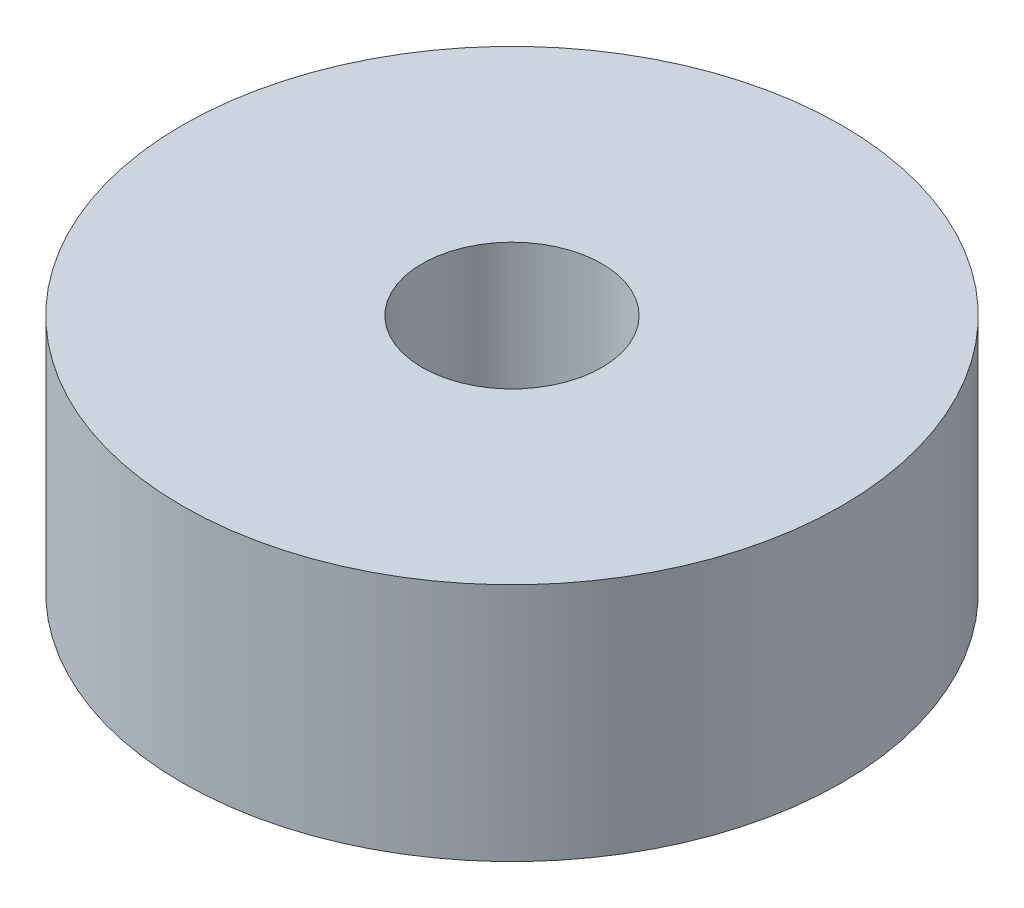
ISO-10303-21;
HEADER;
FILE_DESCRIPTION(('STEP AP214'),'2;1');
FILE_NAME('part.step','',(''),(''),'','','');
FILE_SCHEMA(('AUTOMOTIVE_DESIGN { 1 0 10303 214 1 1 1 1 }'));
ENDSEC;
DATA;
#1=APPLICATION_CONTEXT('core data for automotive mechanical design processes');
#2=APPLICATION_PROTOCOL_DEFINITION('international standard','automotive_design',2000,#1);
#3=PRODUCT_CONTEXT('',#1,'mechanical');
#4=PRODUCT('Part','Part','',(#3));
#5=PRODUCT_RELATED_PRODUCT_CATEGORY('part','',(#4));
#6=PRODUCT_DEFINITION_FORMATION('','',#4);
#7=PRODUCT_DEFINITION_CONTEXT('part definition',#1,'design');
#8=PRODUCT_DEFINITION('design','',#6,#7);
#9=PRODUCT_DEFINITION_SHAPE('','',#8);
#10=(LENGTH_UNIT() NAMED_UNIT(*) SI_UNIT(.MILLI.,.METRE.));
#11=(NAMED_UNIT(*) PLANE_ANGLE_UNIT() SI_UNIT($,.RADIAN.));
#12=(NAMED_UNIT(*) SI_UNIT($,.STERADIAN.) SOLID_ANGLE_UNIT());
#13=UNCERTAINTY_MEASURE_WITH_UNIT(LENGTH_MEASURE(1.E-05),#10,'distance_accuracy_value','');
#14=(GEOMETRIC_REPRESENTATION_CONTEXT(3) GLOBAL_UNCERTAINTY_ASSIGNED_CONTEXT((#13)) GLOBAL_UNIT_ASSIGNED_CONTEXT((#10,
#11,#12)) REPRESENTATION_CONTEXT('',''));
#15=CARTESIAN_POINT('',(0.,0.,0.));
#16=DIRECTION('',(0.,0.,1.));
#17=DIRECTION('',(1.,0.,0.));
#18=AXIS2_PLACEMENT_3D('',#15,#16,#17);
#19=CARTESIAN_POINT('',(0.,4.,0.));
#20=DIRECTION('',(0.,1.,0.));
#21=DIRECTION('',(0.,0.,1.));
#22=AXIS2_PLACEMENT_3D('',#19,#20,#21);
#23=PLANE('',#22);
#24=CARTESIAN_POINT('',(0.,4.,0.));
#25=DIRECTION('',(0.,1.,0.));
#26=DIRECTION('',(0.,0.,1.));
#27=AXIS2_PLACEMENT_3D('',#24,#25,#26);
#28=CIRCLE('',#27,5.5);
#29=CARTESIAN_POINT('',(0.,4.,5.5));
#30=VERTEX_POINT('',#29);
#31=EDGE_CURVE('E10',#30,#30,#28,.T.);
#32=ORIENTED_EDGE('',*,*,#31,.T.);
#33=EDGE_LOOP('',(#32));
#34=FACE_BOUND('',#33,.T.);
#35=CARTESIAN_POINT('',(0.,4.,0.));
#36=DIRECTION('',(0.,1.,0.));
#37=DIRECTION('',(0.,0.,1.));
#38=AXIS2_PLACEMENT_3D('',#35,#36,#37);
#39=CIRCLE('',#38,1.5);
#40=CARTESIAN_POINT('',(0.,4.,1.5));
#41=VERTEX_POINT('',#40);
#42=EDGE_CURVE('E44',#41,#41,#39,.T.);
#43=ORIENTED_EDGE('',*,*,#42,.F.);
#44=EDGE_LOOP('',(#43));
#45=FACE_BOUND('',#44,.T.);
#46=ADVANCED_FACE('F33',(#34,#45),#23,.T.);
#47=CARTESIAN_POINT('',(0.,0.,0.));
#48=DIRECTION('',(0.,1.,0.));
#49=DIRECTION('',(0.,0.,1.));
#50=AXIS2_PLACEMENT_3D('',#47,#48,#49);
#51=PLANE('',#50);
#52=CARTESIAN_POINT('',(0.,0.,0.));
#53=DIRECTION('',(0.,1.,0.));
#54=DIRECTION('',(0.,0.,1.));
#55=AXIS2_PLACEMENT_3D('',#52,#53,#54);
#56=CIRCLE('',#55,5.5);
#57=CARTESIAN_POINT('',(0.,0.,5.5));
#58=VERTEX_POINT('',#57);
#59=EDGE_CURVE('E37',#58,#58,#56,.T.);
#60=ORIENTED_EDGE('',*,*,#59,.F.);
#61=EDGE_LOOP('',(#60));
#62=FACE_BOUND('',#61,.T.);
#63=CARTESIAN_POINT('',(0.,0.,0.));
#64=DIRECTION('',(0.,1.,0.));
#65=DIRECTION('',(0.,0.,1.));
#66=AXIS2_PLACEMENT_3D('',#63,#64,#65);
#67=CIRCLE('',#66,1.5);
#68=CARTESIAN_POINT('',(0.,0.,1.5));
#69=VERTEX_POINT('',#68);
#70=EDGE_CURVE('E46',#69,#69,#67,.T.);
#71=ORIENTED_EDGE('',*,*,#70,.T.);
#72=EDGE_LOOP('',(#71));
#73=FACE_BOUND('',#72,.T.);
#74=ADVANCED_FACE('F56',(#62,#73),#51,.F.);
#75=CARTESIAN_POINT('',(0.,4.,0.));
#76=DIRECTION('',(0.,-1.,0.));
#77=DIRECTION('',(0.,0.,-1.));
#78=AXIS2_PLACEMENT_3D('',#75,#76,#77);
#79=CYLINDRICAL_SURFACE('',#78,5.5);
#80=ORIENTED_EDGE('',*,*,#31,.F.);
#81=EDGE_LOOP('',(#80));
#82=FACE_BOUND('',#81,.T.);
#83=ORIENTED_EDGE('',*,*,#59,.T.);
#84=EDGE_LOOP('',(#83));
#85=FACE_BOUND('',#84,.T.);
#86=ADVANCED_FACE('F35',(#82,#85),#79,.T.);
#87=CARTESIAN_POINT('',(0.,4.,0.));
#88=DIRECTION('',(0.,-1.,0.));
#89=DIRECTION('',(0.,0.,-1.));
#90=AXIS2_PLACEMENT_3D('',#87,#88,#89);
#91=CYLINDRICAL_SURFACE('',#90,1.5);
#92=ORIENTED_EDGE('',*,*,#42,.T.);
#93=EDGE_LOOP('',(#92));
#94=FACE_BOUND('',#93,.T.);
#95=ORIENTED_EDGE('',*,*,#70,.F.);
#96=EDGE_LOOP('',(#95));
#97=FACE_BOUND('',#96,.T.);
#98=ADVANCED_FACE('F52',(#94,#97),#91,.F.);
#99=CLOSED_SHELL('',(#46,#74,#86,#98));
#100=MANIFOLD_SOLID_BREP('B2',#99);
#101=ADVANCED_BREP_SHAPE_REPRESENTATION('',(#18,#100),#14);
#102=SHAPE_DEFINITION_REPRESENTATION(#9,#101);
ENDSEC;
END-ISO-10303-21;
